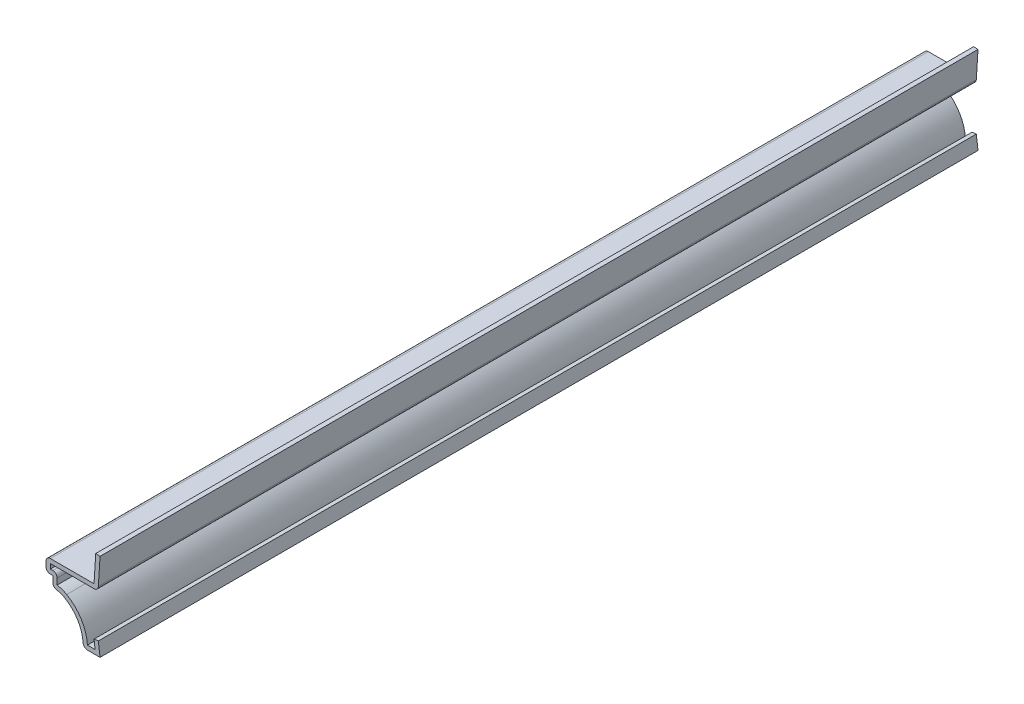
ISO-10303-21;
HEADER;
FILE_DESCRIPTION(('STEP AP214'),'2;1');
FILE_NAME('part.step','',(''),(''),'','','');
FILE_SCHEMA(('AUTOMOTIVE_DESIGN { 1 0 10303 214 1 1 1 1 }'));
ENDSEC;
DATA;
#1=APPLICATION_CONTEXT('core data for automotive mechanical design processes');
#2=APPLICATION_PROTOCOL_DEFINITION('international standard','automotive_design',2000,#1);
#3=PRODUCT_CONTEXT('',#1,'mechanical');
#4=PRODUCT('Part','Part','',(#3));
#5=PRODUCT_RELATED_PRODUCT_CATEGORY('part','',(#4));
#6=PRODUCT_DEFINITION_FORMATION('','',#4);
#7=PRODUCT_DEFINITION_CONTEXT('part definition',#1,'design');
#8=PRODUCT_DEFINITION('design','',#6,#7);
#9=PRODUCT_DEFINITION_SHAPE('','',#8);
#10=(LENGTH_UNIT() NAMED_UNIT(*) SI_UNIT(.MILLI.,.METRE.));
#11=(NAMED_UNIT(*) PLANE_ANGLE_UNIT() SI_UNIT($,.RADIAN.));
#12=(NAMED_UNIT(*) SI_UNIT($,.STERADIAN.) SOLID_ANGLE_UNIT());
#13=UNCERTAINTY_MEASURE_WITH_UNIT(LENGTH_MEASURE(1.E-05),#10,'distance_accuracy_value','');
#14=(GEOMETRIC_REPRESENTATION_CONTEXT(3) GLOBAL_UNCERTAINTY_ASSIGNED_CONTEXT((#13)) GLOBAL_UNIT_ASSIGNED_CONTEXT((#10,
#11,#12)) REPRESENTATION_CONTEXT('',''));
#15=CARTESIAN_POINT('',(0.,0.,0.));
#16=DIRECTION('',(0.,0.,1.));
#17=DIRECTION('',(1.,0.,0.));
#18=AXIS2_PLACEMENT_3D('',#15,#16,#17);
#19=CARTESIAN_POINT('',(-0.396875000000003,14.2241236612663,-206.375));
#20=DIRECTION('',(0.998052578482889,-0.0623782861551803,0.));
#21=DIRECTION('',(0.0623782861551803,0.998052578482889,0.));
#22=AXIS2_PLACEMENT_3D('',#19,#20,#21);
#23=PLANE('',#22);
#24=DIRECTION('',(0.0623782861551803,0.998052578482889,0.));
#25=VECTOR('',#24,1.);
#26=CARTESIAN_POINT('',(-0.396875000000003,14.2241236612663,0.));
#27=LINE('',#26,#25);
#28=CARTESIAN_POINT('',(-0.396875000000003,14.2241236612663,0.));
#29=VERTEX_POINT('',#28);
#30=CARTESIAN_POINT('',(0.,20.5741236612663,0.));
#31=VERTEX_POINT('',#30);
#32=EDGE_CURVE('E345',#29,#31,#27,.T.);
#33=ORIENTED_EDGE('',*,*,#32,.F.);
#34=DIRECTION('',(0.,0.,1.));
#35=VECTOR('',#34,1.);
#36=CARTESIAN_POINT('',(-0.396875000000003,14.2241236612663,-206.375));
#37=LINE('',#36,#35);
#38=CARTESIAN_POINT('',(-0.396875000000003,14.2241236612663,-206.375));
#39=VERTEX_POINT('',#38);
#40=EDGE_CURVE('E11',#29,#39,#37,.F.);
#41=ORIENTED_EDGE('',*,*,#40,.T.);
#42=DIRECTION('',(0.0623782861551803,0.998052578482889,0.));
#43=VECTOR('',#42,1.);
#44=CARTESIAN_POINT('',(-0.396875000000003,14.2241236612663,-206.375));
#45=LINE('',#44,#43);
#46=CARTESIAN_POINT('',(0.,20.5741236612663,-206.375));
#47=VERTEX_POINT('',#46);
#48=EDGE_CURVE('E209',#39,#47,#45,.T.);
#49=ORIENTED_EDGE('',*,*,#48,.T.);
#50=DIRECTION('',(0.,0.,1.));
#51=VECTOR('',#50,1.);
#52=CARTESIAN_POINT('',(0.,20.5741236612663,-206.375));
#53=LINE('',#52,#51);
#54=EDGE_CURVE('E213',#47,#31,#53,.T.);
#55=ORIENTED_EDGE('',*,*,#54,.T.);
#56=EDGE_LOOP('',(#33,#41,#49,#55));
#57=FACE_BOUND('',#56,.T.);
#58=ADVANCED_FACE('F35',(#57),#23,.T.);
#59=CARTESIAN_POINT('',(-12.7,13.2715,-206.375));
#60=DIRECTION('',(0.,-1.,0.));
#61=DIRECTION('',(0.,0.,-1.));
#62=AXIS2_PLACEMENT_3D('',#59,#60,#61);
#63=PLANE('',#62);
#64=DIRECTION('',(1.,0.,0.));
#65=VECTOR('',#64,1.);
#66=CARTESIAN_POINT('',(-12.7,13.2715,-206.375));
#67=LINE('',#66,#65);
#68=CARTESIAN_POINT('',(-11.684,13.2715,-206.375));
#69=VERTEX_POINT('',#68);
#70=CARTESIAN_POINT('',(-1.41089641973862,13.2715,-206.375));
#71=VERTEX_POINT('',#70);
#72=EDGE_CURVE('E233',#69,#71,#67,.T.);
#73=ORIENTED_EDGE('',*,*,#72,.T.);
#74=DIRECTION('',(0.,0.,1.));
#75=VECTOR('',#74,1.);
#76=CARTESIAN_POINT('',(-1.41089641973862,13.2715,-206.375));
#77=LINE('',#76,#75);
#78=CARTESIAN_POINT('',(-1.41089641973862,13.2715,0.));
#79=VERTEX_POINT('',#78);
#80=EDGE_CURVE('E43',#71,#79,#77,.T.);
#81=ORIENTED_EDGE('',*,*,#80,.T.);
#82=DIRECTION('',(1.,0.,0.));
#83=VECTOR('',#82,1.);
#84=CARTESIAN_POINT('',(-12.7,13.2715,0.));
#85=LINE('',#84,#83);
#86=CARTESIAN_POINT('',(-11.684,13.2715,0.));
#87=VERTEX_POINT('',#86);
#88=EDGE_CURVE('E218',#87,#79,#85,.T.);
#89=ORIENTED_EDGE('',*,*,#88,.F.);
#90=DIRECTION('',(0.,0.,1.));
#91=VECTOR('',#90,1.);
#92=CARTESIAN_POINT('',(-11.684,13.2715,-206.375));
#93=LINE('',#92,#91);
#94=EDGE_CURVE('E246',#69,#87,#93,.T.);
#95=ORIENTED_EDGE('',*,*,#94,.F.);
#96=EDGE_LOOP('',(#73,#81,#89,#95));
#97=FACE_BOUND('',#96,.T.);
#98=ADVANCED_FACE('F294',(#97),#63,.T.);
#99=CARTESIAN_POINT('',(-11.684,11.1125,-206.375));
#100=DIRECTION('',(1.,0.,0.));
#101=DIRECTION('',(0.,0.,-1.));
#102=AXIS2_PLACEMENT_3D('',#99,#100,#101);
#103=PLANE('',#102);
#104=DIRECTION('',(0.,1.,0.));
#105=VECTOR('',#104,1.);
#106=CARTESIAN_POINT('',(-11.684,11.1125,0.));
#107=LINE('',#106,#105);
#108=CARTESIAN_POINT('',(-11.684,12.1285,0.));
#109=VERTEX_POINT('',#108);
#110=EDGE_CURVE('E302',#109,#87,#107,.T.);
#111=ORIENTED_EDGE('',*,*,#110,.F.);
#112=DIRECTION('',(0.,0.,1.));
#113=VECTOR('',#112,1.);
#114=CARTESIAN_POINT('',(-11.684,12.1285,-206.375));
#115=LINE('',#114,#113);
#116=CARTESIAN_POINT('',(-11.684,12.1285,-206.375));
#117=VERTEX_POINT('',#116);
#118=EDGE_CURVE('E309',#117,#109,#115,.T.);
#119=ORIENTED_EDGE('',*,*,#118,.F.);
#120=DIRECTION('',(0.,1.,0.));
#121=VECTOR('',#120,1.);
#122=CARTESIAN_POINT('',(-11.684,11.1125,-206.375));
#123=LINE('',#122,#121);
#124=EDGE_CURVE('E238',#117,#69,#123,.T.);
#125=ORIENTED_EDGE('',*,*,#124,.T.);
#126=ORIENTED_EDGE('',*,*,#94,.T.);
#127=EDGE_LOOP('',(#111,#119,#125,#126));
#128=FACE_BOUND('',#127,.T.);
#129=ADVANCED_FACE('F391',(#128),#103,.T.);
#130=CARTESIAN_POINT('',(-11.1125,12.1285,-206.375));
#131=DIRECTION('',(0.,1.,0.));
#132=DIRECTION('',(0.,0.,1.));
#133=AXIS2_PLACEMENT_3D('',#130,#131,#132);
#134=PLANE('',#133);
#135=DIRECTION('',(1.,0.,0.));
#136=VECTOR('',#135,1.);
#137=CARTESIAN_POINT('',(-11.1125,12.1285,0.));
#138=LINE('',#137,#136);
#139=CARTESIAN_POINT('',(-11.1125,12.1285,0.));
#140=VERTEX_POINT('',#139);
#141=EDGE_CURVE('E304',#140,#109,#138,.F.);
#142=ORIENTED_EDGE('',*,*,#141,.F.);
#143=DIRECTION('',(0.,0.,1.));
#144=VECTOR('',#143,1.);
#145=CARTESIAN_POINT('',(-11.1125,12.1285,-206.375));
#146=LINE('',#145,#144);
#147=CARTESIAN_POINT('',(-11.1125,12.1285,-206.375));
#148=VERTEX_POINT('',#147);
#149=EDGE_CURVE('E279',#140,#148,#146,.F.);
#150=ORIENTED_EDGE('',*,*,#149,.T.);
#151=DIRECTION('',(1.,0.,0.));
#152=VECTOR('',#151,1.);
#153=CARTESIAN_POINT('',(-11.1125,12.1285,-206.375));
#154=LINE('',#153,#152);
#155=EDGE_CURVE('E387',#148,#117,#154,.F.);
#156=ORIENTED_EDGE('',*,*,#155,.T.);
#157=ORIENTED_EDGE('',*,*,#118,.T.);
#158=EDGE_LOOP('',(#142,#150,#156,#157));
#159=FACE_BOUND('',#158,.T.);
#160=ADVANCED_FACE('F385',(#159),#134,.T.);
#161=CARTESIAN_POINT('',(-10.0965,8.73125,-206.375));
#162=DIRECTION('',(1.,0.,0.));
#163=DIRECTION('',(0.,0.,-1.));
#164=AXIS2_PLACEMENT_3D('',#161,#162,#163);
#165=PLANE('',#164);
#166=DIRECTION('',(0.,1.,0.));
#167=VECTOR('',#166,1.);
#168=CARTESIAN_POINT('',(-10.0965,8.73125,-206.375));
#169=LINE('',#168,#167);
#170=CARTESIAN_POINT('',(-10.0965,9.66824372424907,-206.375));
#171=VERTEX_POINT('',#170);
#172=CARTESIAN_POINT('',(-10.0965,11.1125,-206.375));
#173=VERTEX_POINT('',#172);
#174=EDGE_CURVE('E465',#171,#173,#169,.T.);
#175=ORIENTED_EDGE('',*,*,#174,.T.);
#176=DIRECTION('',(0.,0.,1.));
#177=VECTOR('',#176,1.);
#178=CARTESIAN_POINT('',(-10.0965,11.1125,-206.375));
#179=LINE('',#178,#177);
#180=CARTESIAN_POINT('',(-10.0965,11.1125,0.));
#181=VERTEX_POINT('',#180);
#182=EDGE_CURVE('E276',#173,#181,#179,.T.);
#183=ORIENTED_EDGE('',*,*,#182,.T.);
#184=DIRECTION('',(0.,1.,0.));
#185=VECTOR('',#184,1.);
#186=CARTESIAN_POINT('',(-10.0965,8.73125,0.));
#187=LINE('',#186,#185);
#188=CARTESIAN_POINT('',(-10.0965,9.66824372424907,0.));
#189=VERTEX_POINT('',#188);
#190=EDGE_CURVE('E379',#189,#181,#187,.T.);
#191=ORIENTED_EDGE('',*,*,#190,.F.);
#192=DIRECTION('',(0.,0.,1.));
#193=VECTOR('',#192,1.);
#194=CARTESIAN_POINT('',(-10.0965,9.66824372424907,-206.375));
#195=LINE('',#194,#193);
#196=EDGE_CURVE('E312',#171,#189,#195,.T.);
#197=ORIENTED_EDGE('',*,*,#196,.F.);
#198=EDGE_LOOP('',(#175,#183,#191,#197));
#199=FACE_BOUND('',#198,.T.);
#200=ADVANCED_FACE('F471',(#199),#165,.T.);
#201=CARTESIAN_POINT('',(-11.1125,3.175,-206.375));
#202=DIRECTION('',(0.,0.,1.));
#203=DIRECTION('',(1.,0.,0.));
#204=AXIS2_PLACEMENT_3D('',#201,#202,#203);
#205=CYLINDRICAL_SURFACE('',#204,6.57225);
#206=CARTESIAN_POINT('',(-11.1125,3.175,0.));
#207=DIRECTION('',(0.,0.,1.));
#208=DIRECTION('',(1.,0.,0.));
#209=AXIS2_PLACEMENT_3D('',#206,#207,#208);
#210=CIRCLE('',#209,6.57225);
#211=CARTESIAN_POINT('',(-7.84725470729786,8.87873940857982,0.));
#212=VERTEX_POINT('',#211);
#213=EDGE_CURVE('E376',#212,#189,#210,.T.);
#214=ORIENTED_EDGE('',*,*,#213,.F.);
#215=DIRECTION('',(0.,0.,1.));
#216=VECTOR('',#215,1.);
#217=CARTESIAN_POINT('',(-7.84725470729786,8.87873940857982,-206.375));
#218=LINE('',#217,#216);
#219=CARTESIAN_POINT('',(-7.84725470729786,8.87873940857982,-206.375));
#220=VERTEX_POINT('',#219);
#221=EDGE_CURVE('E314',#220,#212,#218,.T.);
#222=ORIENTED_EDGE('',*,*,#221,.F.);
#223=CARTESIAN_POINT('',(-11.1125,3.175,-206.375));
#224=DIRECTION('',(0.,0.,1.));
#225=DIRECTION('',(1.,0.,0.));
#226=AXIS2_PLACEMENT_3D('',#223,#224,#225);
#227=CIRCLE('',#226,6.57225);
#228=EDGE_CURVE('E462',#220,#171,#227,.T.);
#229=ORIENTED_EDGE('',*,*,#228,.T.);
#230=ORIENTED_EDGE('',*,*,#196,.T.);
#231=EDGE_LOOP('',(#214,#222,#229,#230));
#232=FACE_BOUND('',#231,.T.);
#233=ADVANCED_FACE('F478',(#232),#205,.T.);
#234=CARTESIAN_POINT('',(-12.6899131848803,0.419570334019411,-206.375));
#235=DIRECTION('',(0.,0.,1.));
#236=DIRECTION('',(1.,0.,0.));
#237=AXIS2_PLACEMENT_3D('',#234,#235,#236);
#238=CYLINDRICAL_SURFACE('',#237,9.74725);
#239=CARTESIAN_POINT('',(-12.6899131848803,0.419570334019411,0.));
#240=DIRECTION('',(0.,0.,1.));
#241=DIRECTION('',(1.,0.,0.));
#242=AXIS2_PLACEMENT_3D('',#239,#240,#241);
#243=CIRCLE('',#242,9.74725);
#244=CARTESIAN_POINT('',(-2.96092792350597,1.016,0.));
#245=VERTEX_POINT('',#244);
#246=EDGE_CURVE('E373',#245,#212,#243,.T.);
#247=ORIENTED_EDGE('',*,*,#246,.F.);
#248=DIRECTION('',(0.,0.,1.));
#249=VECTOR('',#248,1.);
#250=CARTESIAN_POINT('',(-2.96092792350597,1.016,-206.375));
#251=LINE('',#250,#249);
#252=CARTESIAN_POINT('',(-2.96092792350597,1.016,-206.375));
#253=VERTEX_POINT('',#252);
#254=EDGE_CURVE('E316',#253,#245,#251,.T.);
#255=ORIENTED_EDGE('',*,*,#254,.F.);
#256=CARTESIAN_POINT('',(-12.6899131848803,0.419570334019411,-206.375));
#257=DIRECTION('',(0.,0.,1.));
#258=DIRECTION('',(1.,0.,0.));
#259=AXIS2_PLACEMENT_3D('',#256,#257,#258);
#260=CIRCLE('',#259,9.74725);
#261=EDGE_CURVE('E459',#253,#220,#260,.T.);
#262=ORIENTED_EDGE('',*,*,#261,.T.);
#263=ORIENTED_EDGE('',*,*,#221,.T.);
#264=EDGE_LOOP('',(#247,#255,#262,#263));
#265=FACE_BOUND('',#264,.T.);
#266=ADVANCED_FACE('F481',(#265),#238,.T.);
#267=CARTESIAN_POINT('',(0.,1.016,-206.375));
#268=DIRECTION('',(0.,1.,0.));
#269=DIRECTION('',(-1.,0.,0.));
#270=AXIS2_PLACEMENT_3D('',#267,#268,#269);
#271=PLANE('',#270);
#272=DIRECTION('',(-1.,0.,0.));
#273=VECTOR('',#272,1.);
#274=CARTESIAN_POINT('',(0.,1.016,0.));
#275=LINE('',#274,#273);
#276=CARTESIAN_POINT('',(-1.15203571373212,1.016,0.));
#277=VERTEX_POINT('',#276);
#278=EDGE_CURVE('E370',#277,#245,#275,.T.);
#279=ORIENTED_EDGE('',*,*,#278,.F.);
#280=DIRECTION('',(0.,0.,1.));
#281=VECTOR('',#280,1.);
#282=CARTESIAN_POINT('',(-1.15203571373212,1.016,-206.375));
#283=LINE('',#282,#281);
#284=CARTESIAN_POINT('',(-1.15203571373212,1.016,-206.375));
#285=VERTEX_POINT('',#284);
#286=EDGE_CURVE('E318',#285,#277,#283,.T.);
#287=ORIENTED_EDGE('',*,*,#286,.F.);
#288=DIRECTION('',(-1.,0.,0.));
#289=VECTOR('',#288,1.);
#290=CARTESIAN_POINT('',(0.,1.016,-206.375));
#291=LINE('',#290,#289);
#292=EDGE_CURVE('E456',#285,#253,#291,.T.);
#293=ORIENTED_EDGE('',*,*,#292,.T.);
#294=ORIENTED_EDGE('',*,*,#254,.T.);
#295=EDGE_LOOP('',(#279,#287,#293,#294));
#296=FACE_BOUND('',#295,.T.);
#297=ADVANCED_FACE('F486',(#296),#271,.T.);
#298=CARTESIAN_POINT('',(-1.40490624951561,3.02309765473628,-206.375));
#299=DIRECTION('',(-0.992156741649221,-0.125,0.));
#300=DIRECTION('',(0.125,-0.992156741649222,0.));
#301=AXIS2_PLACEMENT_3D('',#298,#299,#300);
#302=PLANE('',#301);
#303=DIRECTION('',(0.125,-0.992156741649221,0.));
#304=VECTOR('',#303,1.);
#305=CARTESIAN_POINT('',(-1.40490624951561,3.02309765473628,0.));
#306=LINE('',#305,#304);
#307=CARTESIAN_POINT('',(-1.40490624951561,3.02309765473628,0.));
#308=VERTEX_POINT('',#307);
#309=EDGE_CURVE('E367',#308,#277,#306,.T.);
#310=ORIENTED_EDGE('',*,*,#309,.F.);
#311=DIRECTION('',(0.,0.,1.));
#312=VECTOR('',#311,1.);
#313=CARTESIAN_POINT('',(-1.40490624951561,3.02309765473628,-206.375));
#314=LINE('',#313,#312);
#315=CARTESIAN_POINT('',(-1.40490624951561,3.02309765473628,-206.375));
#316=VERTEX_POINT('',#315);
#317=EDGE_CURVE('E320',#316,#308,#314,.T.);
#318=ORIENTED_EDGE('',*,*,#317,.F.);
#319=DIRECTION('',(0.125,-0.992156741649221,0.));
#320=VECTOR('',#319,1.);
#321=CARTESIAN_POINT('',(-1.40490624951561,3.02309765473628,-206.375));
#322=LINE('',#321,#320);
#323=EDGE_CURVE('E453',#316,#285,#322,.T.);
#324=ORIENTED_EDGE('',*,*,#323,.T.);
#325=ORIENTED_EDGE('',*,*,#286,.T.);
#326=EDGE_LOOP('',(#310,#318,#324,#325));
#327=FACE_BOUND('',#326,.T.);
#328=ADVANCED_FACE('F489',(#327),#302,.T.);
#329=CARTESIAN_POINT('',(-1.40490624951561,3.02309765473628,-206.375));
#330=DIRECTION('',(0.125,-0.992156741649222,0.));
#331=DIRECTION('',(0.992156741649222,0.125,0.));
#332=AXIS2_PLACEMENT_3D('',#329,#330,#331);
#333=PLANE('',#332);
#334=DIRECTION('',(0.992156741649222,0.125,0.));
#335=VECTOR('',#334,1.);
#336=CARTESIAN_POINT('',(-1.40490624951561,3.02309765473628,0.));
#337=LINE('',#336,#335);
#338=CARTESIAN_POINT('',(-0.396875,3.15009765473628,0.));
#339=VERTEX_POINT('',#338);
#340=EDGE_CURVE('E365',#308,#339,#337,.T.);
#341=ORIENTED_EDGE('',*,*,#340,.T.);
#342=DIRECTION('',(0.,0.,1.));
#343=VECTOR('',#342,1.);
#344=CARTESIAN_POINT('',(-0.396875,3.15009765473628,-206.375));
#345=LINE('',#344,#343);
#346=CARTESIAN_POINT('',(-0.396875,3.15009765473628,-206.375));
#347=VERTEX_POINT('',#346);
#348=EDGE_CURVE('E322',#347,#339,#345,.T.);
#349=ORIENTED_EDGE('',*,*,#348,.F.);
#350=DIRECTION('',(0.992156741649222,0.125,0.));
#351=VECTOR('',#350,1.);
#352=CARTESIAN_POINT('',(-1.40490624951561,3.02309765473628,-206.375));
#353=LINE('',#352,#351);
#354=EDGE_CURVE('E451',#316,#347,#353,.T.);
#355=ORIENTED_EDGE('',*,*,#354,.F.);
#356=ORIENTED_EDGE('',*,*,#317,.T.);
#357=EDGE_LOOP('',(#341,#349,#355,#356));
#358=FACE_BOUND('',#357,.T.);
#359=ADVANCED_FACE('F495',(#358),#333,.F.);
#360=CARTESIAN_POINT('',(-0.396875,3.15009765473628,-206.375));
#361=DIRECTION('',(-0.992156741649221,-0.125,0.));
#362=DIRECTION('',(0.125,-0.992156741649222,0.));
#363=AXIS2_PLACEMENT_3D('',#360,#361,#362);
#364=PLANE('',#363);
#365=DIRECTION('',(0.125,-0.992156741649221,0.));
#366=VECTOR('',#365,1.);
#367=CARTESIAN_POINT('',(-0.396875,3.15009765473628,0.));
#368=LINE('',#367,#366);
#369=CARTESIAN_POINT('',(0.,0.,0.));
#370=VERTEX_POINT('',#369);
#371=EDGE_CURVE('E363',#339,#370,#368,.T.);
#372=ORIENTED_EDGE('',*,*,#371,.T.);
#373=DIRECTION('',(0.,0.,1.));
#374=VECTOR('',#373,1.);
#375=CARTESIAN_POINT('',(0.,0.,-206.375));
#376=LINE('',#375,#374);
#377=CARTESIAN_POINT('',(0.,0.,-206.375));
#378=VERTEX_POINT('',#377);
#379=EDGE_CURVE('E325',#378,#370,#376,.T.);
#380=ORIENTED_EDGE('',*,*,#379,.F.);
#381=DIRECTION('',(0.125,-0.992156741649221,0.));
#382=VECTOR('',#381,1.);
#383=CARTESIAN_POINT('',(-0.396875,3.15009765473628,-206.375));
#384=LINE('',#383,#382);
#385=EDGE_CURVE('E449',#347,#378,#384,.T.);
#386=ORIENTED_EDGE('',*,*,#385,.F.);
#387=ORIENTED_EDGE('',*,*,#348,.T.);
#388=EDGE_LOOP('',(#372,#380,#386,#387));
#389=FACE_BOUND('',#388,.T.);
#390=ADVANCED_FACE('F499',(#389),#364,.F.);
#391=CARTESIAN_POINT('',(0.,0.,-206.375));
#392=DIRECTION('',(0.,1.,0.));
#393=DIRECTION('',(-1.,0.,0.));
#394=AXIS2_PLACEMENT_3D('',#391,#392,#393);
#395=PLANE('',#394);
#396=DIRECTION('',(-1.,0.,0.));
#397=VECTOR('',#396,1.);
#398=CARTESIAN_POINT('',(0.,0.,0.));
#399=LINE('',#398,#397);
#400=CARTESIAN_POINT('',(-2.96092792350597,0.,0.));
#401=VERTEX_POINT('',#400);
#402=EDGE_CURVE('E360',#370,#401,#399,.T.);
#403=ORIENTED_EDGE('',*,*,#402,.T.);
#404=DIRECTION('',(0.,0.,1.));
#405=VECTOR('',#404,1.);
#406=CARTESIAN_POINT('',(-2.96092792350597,0.,-206.375));
#407=LINE('',#406,#405);
#408=CARTESIAN_POINT('',(-2.96092792350597,0.,-206.375));
#409=VERTEX_POINT('',#408);
#410=EDGE_CURVE('E258',#401,#409,#407,.F.);
#411=ORIENTED_EDGE('',*,*,#410,.T.);
#412=DIRECTION('',(-1.,0.,0.));
#413=VECTOR('',#412,1.);
#414=CARTESIAN_POINT('',(0.,0.,-206.375));
#415=LINE('',#414,#413);
#416=EDGE_CURVE('E447',#378,#409,#415,.T.);
#417=ORIENTED_EDGE('',*,*,#416,.F.);
#418=ORIENTED_EDGE('',*,*,#379,.T.);
#419=EDGE_LOOP('',(#403,#411,#417,#418));
#420=FACE_BOUND('',#419,.T.);
#421=ADVANCED_FACE('F503',(#420),#395,.F.);
#422=CARTESIAN_POINT('',(-12.6899131848803,0.419570334019411,-206.375));
#423=DIRECTION('',(0.,0.,1.));
#424=DIRECTION('',(1.,0.,0.));
#425=AXIS2_PLACEMENT_3D('',#422,#423,#424);
#426=CYLINDRICAL_SURFACE('',#425,8.73125);
#427=CARTESIAN_POINT('',(-12.6899131848803,0.419570334019411,-206.375));
#428=DIRECTION('',(0.,0.,1.));
#429=DIRECTION('',(-1.,0.,0.));
#430=AXIS2_PLACEMENT_3D('',#427,#428,#429);
#431=CIRCLE('',#430,8.73125);
#432=CARTESIAN_POINT('',(-3.97502410710198,0.953831435467821,-206.375));
#433=VERTEX_POINT('',#432);
#434=CARTESIAN_POINT('',(-8.35202692645954,7.99700191546603,-206.375));
#435=VERTEX_POINT('',#434);
#436=EDGE_CURVE('E445',#433,#435,#431,.T.);
#437=ORIENTED_EDGE('',*,*,#436,.F.);
#438=DIRECTION('',(0.,0.,1.));
#439=VECTOR('',#438,1.);
#440=CARTESIAN_POINT('',(-3.97502410710198,0.953831435467821,-206.375));
#441=LINE('',#440,#439);
#442=CARTESIAN_POINT('',(-3.97502410710198,0.953831435467821,0.));
#443=VERTEX_POINT('',#442);
#444=EDGE_CURVE('E242',#433,#443,#441,.T.);
#445=ORIENTED_EDGE('',*,*,#444,.T.);
#446=CARTESIAN_POINT('',(-12.6899131848803,0.419570334019411,0.));
#447=DIRECTION('',(0.,0.,1.));
#448=DIRECTION('',(-1.,0.,0.));
#449=AXIS2_PLACEMENT_3D('',#446,#447,#448);
#450=CIRCLE('',#449,8.73125);
#451=CARTESIAN_POINT('',(-8.35202692645954,7.99700191546603,0.));
#452=VERTEX_POINT('',#451);
#453=EDGE_CURVE('E358',#443,#452,#450,.T.);
#454=ORIENTED_EDGE('',*,*,#453,.T.);
#455=DIRECTION('',(0.,0.,1.));
#456=VECTOR('',#455,1.);
#457=CARTESIAN_POINT('',(-8.35202692645954,7.99700191546603,-206.375));
#458=LINE('',#457,#456);
#459=EDGE_CURVE('E328',#435,#452,#458,.T.);
#460=ORIENTED_EDGE('',*,*,#459,.F.);
#461=EDGE_LOOP('',(#437,#445,#454,#460));
#462=FACE_BOUND('',#461,.T.);
#463=ADVANCED_FACE('F509',(#462),#426,.F.);
#464=CARTESIAN_POINT('',(-11.1125,3.175,-206.375));
#465=DIRECTION('',(0.,0.,1.));
#466=DIRECTION('',(1.,0.,0.));
#467=AXIS2_PLACEMENT_3D('',#464,#465,#466);
#468=CYLINDRICAL_SURFACE('',#467,5.55625);
#469=CARTESIAN_POINT('',(-11.1125,3.175,0.));
#470=DIRECTION('',(0.,0.,1.));
#471=DIRECTION('',(-1.,0.,0.));
#472=AXIS2_PLACEMENT_3D('',#469,#470,#471);
#473=CIRCLE('',#472,5.55625);
#474=CARTESIAN_POINT('',(-10.2535628019324,8.66445725479994,0.));
#475=VERTEX_POINT('',#474);
#476=EDGE_CURVE('E355',#452,#475,#473,.T.);
#477=ORIENTED_EDGE('',*,*,#476,.T.);
#478=DIRECTION('',(0.,0.,1.));
#479=VECTOR('',#478,1.);
#480=CARTESIAN_POINT('',(-10.2535628019324,8.66445725479994,-206.375));
#481=LINE('',#480,#479);
#482=CARTESIAN_POINT('',(-10.2535628019324,8.66445725479994,-206.375));
#483=VERTEX_POINT('',#482);
#484=EDGE_CURVE('E274',#475,#483,#481,.F.);
#485=ORIENTED_EDGE('',*,*,#484,.T.);
#486=CARTESIAN_POINT('',(-11.1125,3.175,-206.375));
#487=DIRECTION('',(0.,0.,1.));
#488=DIRECTION('',(-1.,0.,0.));
#489=AXIS2_PLACEMENT_3D('',#486,#487,#488);
#490=CIRCLE('',#489,5.55625);
#491=EDGE_CURVE('E442',#435,#483,#490,.T.);
#492=ORIENTED_EDGE('',*,*,#491,.F.);
#493=ORIENTED_EDGE('',*,*,#459,.T.);
#494=EDGE_LOOP('',(#477,#485,#492,#493));
#495=FACE_BOUND('',#494,.T.);
#496=ADVANCED_FACE('F515',(#495),#468,.F.);
#497=CARTESIAN_POINT('',(-11.1125,8.73125,-206.375));
#498=DIRECTION('',(1.,0.,0.));
#499=DIRECTION('',(0.,0.,-1.));
#500=AXIS2_PLACEMENT_3D('',#497,#498,#499);
#501=PLANE('',#500);
#502=DIRECTION('',(0.,1.,0.));
#503=VECTOR('',#502,1.);
#504=CARTESIAN_POINT('',(-11.1125,8.73125,-206.375));
#505=LINE('',#504,#503);
#506=CARTESIAN_POINT('',(-11.1125,9.66824372424907,-206.375));
#507=VERTEX_POINT('',#506);
#508=CARTESIAN_POINT('',(-11.1125,11.1125,-206.375));
#509=VERTEX_POINT('',#508);
#510=EDGE_CURVE('E436',#507,#509,#505,.T.);
#511=ORIENTED_EDGE('',*,*,#510,.F.);
#512=DIRECTION('',(0.,0.,1.));
#513=VECTOR('',#512,1.);
#514=CARTESIAN_POINT('',(-11.1125,9.66824372424907,-206.375));
#515=LINE('',#514,#513);
#516=CARTESIAN_POINT('',(-11.1125,9.66824372424907,0.));
#517=VERTEX_POINT('',#516);
#518=EDGE_CURVE('E271',#507,#517,#515,.T.);
#519=ORIENTED_EDGE('',*,*,#518,.T.);
#520=DIRECTION('',(0.,1.,0.));
#521=VECTOR('',#520,1.);
#522=CARTESIAN_POINT('',(-11.1125,8.73125,0.));
#523=LINE('',#522,#521);
#524=CARTESIAN_POINT('',(-11.1125,11.1125,0.));
#525=VERTEX_POINT('',#524);
#526=EDGE_CURVE('E353',#517,#525,#523,.T.);
#527=ORIENTED_EDGE('',*,*,#526,.T.);
#528=DIRECTION('',(0.,0.,1.));
#529=VECTOR('',#528,1.);
#530=CARTESIAN_POINT('',(-11.1125,11.1125,-206.375));
#531=LINE('',#530,#529);
#532=EDGE_CURVE('E331',#509,#525,#531,.T.);
#533=ORIENTED_EDGE('',*,*,#532,.F.);
#534=EDGE_LOOP('',(#511,#519,#527,#533));
#535=FACE_BOUND('',#534,.T.);
#536=ADVANCED_FACE('F522',(#535),#501,.F.);
#537=CARTESIAN_POINT('',(-11.1125,11.1125,-206.375));
#538=DIRECTION('',(0.,1.,0.));
#539=DIRECTION('',(0.,0.,1.));
#540=AXIS2_PLACEMENT_3D('',#537,#538,#539);
#541=PLANE('',#540);
#542=DIRECTION('',(-1.,0.,0.));
#543=VECTOR('',#542,1.);
#544=CARTESIAN_POINT('',(-11.1125,11.1125,0.));
#545=LINE('',#544,#543);
#546=CARTESIAN_POINT('',(-11.684,11.1125,0.));
#547=VERTEX_POINT('',#546);
#548=EDGE_CURVE('E350',#525,#547,#545,.T.);
#549=ORIENTED_EDGE('',*,*,#548,.T.);
#550=DIRECTION('',(0.,0.,1.));
#551=VECTOR('',#550,1.);
#552=CARTESIAN_POINT('',(-11.684,11.1125,-206.375));
#553=LINE('',#552,#551);
#554=CARTESIAN_POINT('',(-11.684,11.1125,-206.375));
#555=VERTEX_POINT('',#554);
#556=EDGE_CURVE('E285',#547,#555,#553,.F.);
#557=ORIENTED_EDGE('',*,*,#556,.T.);
#558=DIRECTION('',(-1.,0.,0.));
#559=VECTOR('',#558,1.);
#560=CARTESIAN_POINT('',(-11.1125,11.1125,-206.375));
#561=LINE('',#560,#559);
#562=EDGE_CURVE('E431',#509,#555,#561,.T.);
#563=ORIENTED_EDGE('',*,*,#562,.F.);
#564=ORIENTED_EDGE('',*,*,#532,.T.);
#565=EDGE_LOOP('',(#549,#557,#563,#564));
#566=FACE_BOUND('',#565,.T.);
#567=ADVANCED_FACE('F525',(#566),#541,.F.);
#568=CARTESIAN_POINT('',(-12.7,11.1125,-206.375));
#569=DIRECTION('',(1.,0.,0.));
#570=DIRECTION('',(0.,0.,-1.));
#571=AXIS2_PLACEMENT_3D('',#568,#569,#570);
#572=PLANE('',#571);
#573=DIRECTION('',(0.,1.,0.));
#574=VECTOR('',#573,1.);
#575=CARTESIAN_POINT('',(-12.7,11.1125,-206.375));
#576=LINE('',#575,#574);
#577=CARTESIAN_POINT('',(-12.7,12.1285,-206.375));
#578=VERTEX_POINT('',#577);
#579=CARTESIAN_POINT('',(-12.7,13.2715,-206.375));
#580=VERTEX_POINT('',#579);
#581=EDGE_CURVE('E429',#578,#580,#576,.T.);
#582=ORIENTED_EDGE('',*,*,#581,.F.);
#583=DIRECTION('',(0.,0.,1.));
#584=VECTOR('',#583,1.);
#585=CARTESIAN_POINT('',(-12.7,12.1285,-206.375));
#586=LINE('',#585,#584);
#587=CARTESIAN_POINT('',(-12.7,12.1285,0.));
#588=VERTEX_POINT('',#587);
#589=EDGE_CURVE('E282',#578,#588,#586,.T.);
#590=ORIENTED_EDGE('',*,*,#589,.T.);
#591=DIRECTION('',(0.,1.,0.));
#592=VECTOR('',#591,1.);
#593=CARTESIAN_POINT('',(-12.7,11.1125,0.));
#594=LINE('',#593,#592);
#595=CARTESIAN_POINT('',(-12.7,13.2715,0.));
#596=VERTEX_POINT('',#595);
#597=EDGE_CURVE('E343',#588,#596,#594,.T.);
#598=ORIENTED_EDGE('',*,*,#597,.T.);
#599=DIRECTION('',(0.,0.,1.));
#600=VECTOR('',#599,1.);
#601=CARTESIAN_POINT('',(-12.7,13.2715,-206.375));
#602=LINE('',#601,#600);
#603=EDGE_CURVE('E58',#596,#580,#602,.F.);
#604=ORIENTED_EDGE('',*,*,#603,.T.);
#605=EDGE_LOOP('',(#582,#590,#598,#604));
#606=FACE_BOUND('',#605,.T.);
#607=ADVANCED_FACE('F432',(#606),#572,.F.);
#608=CARTESIAN_POINT('',(-12.7,14.2875,-206.375));
#609=DIRECTION('',(0.,-1.,0.));
#610=DIRECTION('',(0.,0.,-1.));
#611=AXIS2_PLACEMENT_3D('',#608,#609,#610);
#612=PLANE('',#611);
#613=DIRECTION('',(1.,0.,0.));
#614=VECTOR('',#613,1.);
#615=CARTESIAN_POINT('',(-12.7,14.2875,-206.375));
#616=LINE('',#615,#614);
#617=CARTESIAN_POINT('',(-11.684,14.2875,-206.375));
#618=VERTEX_POINT('',#617);
#619=CARTESIAN_POINT('',(-1.41089641973862,14.2875,-206.375));
#620=VERTEX_POINT('',#619);
#621=EDGE_CURVE('E434',#618,#620,#616,.T.);
#622=ORIENTED_EDGE('',*,*,#621,.F.);
#623=DIRECTION('',(0.,0.,1.));
#624=VECTOR('',#623,1.);
#625=CARTESIAN_POINT('',(-11.684,14.2875,-206.375));
#626=LINE('',#625,#624);
#627=CARTESIAN_POINT('',(-11.684,14.2875,0.));
#628=VERTEX_POINT('',#627);
#629=EDGE_CURVE('E287',#618,#628,#626,.T.);
#630=ORIENTED_EDGE('',*,*,#629,.T.);
#631=DIRECTION('',(1.,0.,0.));
#632=VECTOR('',#631,1.);
#633=CARTESIAN_POINT('',(-12.7,14.2875,0.));
#634=LINE('',#633,#632);
#635=CARTESIAN_POINT('',(-1.41089641973862,14.2875,0.));
#636=VERTEX_POINT('',#635);
#637=EDGE_CURVE('E341',#628,#636,#634,.T.);
#638=ORIENTED_EDGE('',*,*,#637,.T.);
#639=DIRECTION('',(0.,0.,1.));
#640=VECTOR('',#639,1.);
#641=CARTESIAN_POINT('',(-1.41089641973862,14.2875,-206.375));
#642=LINE('',#641,#640);
#643=EDGE_CURVE('E235',#620,#636,#642,.T.);
#644=ORIENTED_EDGE('',*,*,#643,.F.);
#645=EDGE_LOOP('',(#622,#630,#638,#644));
#646=FACE_BOUND('',#645,.T.);
#647=ADVANCED_FACE('F527',(#646),#612,.F.);
#648=CARTESIAN_POINT('',(-1.41089641973862,14.2875,-206.375));
#649=DIRECTION('',(0.998052578482889,-0.0623782861551803,0.));
#650=DIRECTION('',(0.0623782861551803,0.998052578482889,0.));
#651=AXIS2_PLACEMENT_3D('',#648,#649,#650);
#652=PLANE('',#651);
#653=DIRECTION('',(0.0623782861551803,0.998052578482889,0.));
#654=VECTOR('',#653,1.);
#655=CARTESIAN_POINT('',(-1.41089641973862,14.2875,0.));
#656=LINE('',#655,#654);
#657=CARTESIAN_POINT('',(-1.01402141973862,20.6375,0.));
#658=VERTEX_POINT('',#657);
#659=EDGE_CURVE('E338',#636,#658,#656,.T.);
#660=ORIENTED_EDGE('',*,*,#659,.T.);
#661=DIRECTION('',(0.,0.,1.));
#662=VECTOR('',#661,1.);
#663=CARTESIAN_POINT('',(-1.01402141973862,20.6375,-206.375));
#664=LINE('',#663,#662);
#665=CARTESIAN_POINT('',(-1.01402141973862,20.6375,-206.375));
#666=VERTEX_POINT('',#665);
#667=EDGE_CURVE('E232',#666,#658,#664,.T.);
#668=ORIENTED_EDGE('',*,*,#667,.F.);
#669=DIRECTION('',(0.0623782861551803,0.998052578482889,0.));
#670=VECTOR('',#669,1.);
#671=CARTESIAN_POINT('',(-1.41089641973862,14.2875,-206.375));
#672=LINE('',#671,#670);
#673=EDGE_CURVE('E224',#620,#666,#672,.T.);
#674=ORIENTED_EDGE('',*,*,#673,.F.);
#675=ORIENTED_EDGE('',*,*,#643,.T.);
#676=EDGE_LOOP('',(#660,#668,#674,#675));
#677=FACE_BOUND('',#676,.T.);
#678=ADVANCED_FACE('F337',(#677),#652,.F.);
#679=CARTESIAN_POINT('',(-1.01402141973862,20.6375,-206.375));
#680=DIRECTION('',(-0.0623782861551768,-0.998052578482889,0.));
#681=DIRECTION('',(0.998052578482889,-0.0623782861551768,0.));
#682=AXIS2_PLACEMENT_3D('',#679,#680,#681);
#683=PLANE('',#682);
#684=DIRECTION('',(0.998052578482889,-0.0623782861551768,0.));
#685=VECTOR('',#684,1.);
#686=CARTESIAN_POINT('',(-1.01402141973862,20.6375,0.));
#687=LINE('',#686,#685);
#688=EDGE_CURVE('E231',#658,#31,#687,.T.);
#689=ORIENTED_EDGE('',*,*,#688,.T.);
#690=ORIENTED_EDGE('',*,*,#54,.F.);
#691=DIRECTION('',(0.998052578482889,-0.0623782861551768,0.));
#692=VECTOR('',#691,1.);
#693=CARTESIAN_POINT('',(-1.01402141973862,20.6375,-206.375));
#694=LINE('',#693,#692);
#695=EDGE_CURVE('E217',#666,#47,#694,.T.);
#696=ORIENTED_EDGE('',*,*,#695,.F.);
#697=ORIENTED_EDGE('',*,*,#667,.T.);
#698=EDGE_LOOP('',(#689,#690,#696,#697));
#699=FACE_BOUND('',#698,.T.);
#700=ADVANCED_FACE('F229',(#699),#683,.F.);
#701=CARTESIAN_POINT('',(-11.1125,3.175,-206.375));
#702=DIRECTION('',(0.,0.,1.));
#703=DIRECTION('',(1.,0.,0.));
#704=AXIS2_PLACEMENT_3D('',#701,#702,#703);
#705=PLANE('',#704);
#706=ORIENTED_EDGE('',*,*,#416,.T.);
#707=CARTESIAN_POINT('',(-2.96092792350597,1.016,-206.375));
#708=DIRECTION('',(0.,0.,1.));
#709=DIRECTION('',(1.,0.,0.));
#710=AXIS2_PLACEMENT_3D('',#707,#708,#709);
#711=CIRCLE('',#710,1.016);
#712=EDGE_CURVE('E269',#409,#433,#711,.F.);
#713=ORIENTED_EDGE('',*,*,#712,.T.);
#714=ORIENTED_EDGE('',*,*,#436,.T.);
#715=ORIENTED_EDGE('',*,*,#491,.T.);
#716=CARTESIAN_POINT('',(-10.0965,9.66824372424907,-206.375));
#717=DIRECTION('',(0.,0.,1.));
#718=DIRECTION('',(1.,0.,0.));
#719=AXIS2_PLACEMENT_3D('',#716,#717,#718);
#720=CIRCLE('',#719,1.016);
#721=EDGE_CURVE('E267',#483,#507,#720,.F.);
#722=ORIENTED_EDGE('',*,*,#721,.T.);
#723=ORIENTED_EDGE('',*,*,#510,.T.);
#724=ORIENTED_EDGE('',*,*,#562,.T.);
#725=CARTESIAN_POINT('',(-11.684,12.1285,-206.375));
#726=DIRECTION('',(0.,0.,1.));
#727=DIRECTION('',(1.,0.,0.));
#728=AXIS2_PLACEMENT_3D('',#725,#726,#727);
#729=CIRCLE('',#728,1.016);
#730=EDGE_CURVE('E263',#555,#578,#729,.F.);
#731=ORIENTED_EDGE('',*,*,#730,.T.);
#732=ORIENTED_EDGE('',*,*,#581,.T.);
#733=CARTESIAN_POINT('',(-11.684,13.2715,-206.375));
#734=DIRECTION('',(0.,0.,1.));
#735=DIRECTION('',(1.,0.,0.));
#736=AXIS2_PLACEMENT_3D('',#733,#734,#735);
#737=CIRCLE('',#736,1.016);
#738=EDGE_CURVE('E50',#580,#618,#737,.F.);
#739=ORIENTED_EDGE('',*,*,#738,.T.);
#740=ORIENTED_EDGE('',*,*,#621,.T.);
#741=ORIENTED_EDGE('',*,*,#673,.T.);
#742=ORIENTED_EDGE('',*,*,#695,.T.);
#743=ORIENTED_EDGE('',*,*,#48,.F.);
#744=CARTESIAN_POINT('',(-1.41089641973862,14.2875,-206.375));
#745=DIRECTION('',(0.,0.,1.));
#746=DIRECTION('',(1.,0.,0.));
#747=AXIS2_PLACEMENT_3D('',#744,#745,#746);
#748=CIRCLE('',#747,1.016);
#749=EDGE_CURVE('E260',#39,#71,#748,.F.);
#750=ORIENTED_EDGE('',*,*,#749,.T.);
#751=ORIENTED_EDGE('',*,*,#72,.F.);
#752=ORIENTED_EDGE('',*,*,#124,.F.);
#753=ORIENTED_EDGE('',*,*,#155,.F.);
#754=CARTESIAN_POINT('',(-11.1125,11.1125,-206.375));
#755=DIRECTION('',(0.,0.,1.));
#756=DIRECTION('',(1.,0.,0.));
#757=AXIS2_PLACEMENT_3D('',#754,#755,#756);
#758=CIRCLE('',#757,1.016);
#759=EDGE_CURVE('E265',#148,#173,#758,.F.);
#760=ORIENTED_EDGE('',*,*,#759,.T.);
#761=ORIENTED_EDGE('',*,*,#174,.F.);
#762=ORIENTED_EDGE('',*,*,#228,.F.);
#763=ORIENTED_EDGE('',*,*,#261,.F.);
#764=ORIENTED_EDGE('',*,*,#292,.F.);
#765=ORIENTED_EDGE('',*,*,#323,.F.);
#766=ORIENTED_EDGE('',*,*,#354,.T.);
#767=ORIENTED_EDGE('',*,*,#385,.T.);
#768=EDGE_LOOP('',(#706,#713,#714,#715,#722,#723,#724,#731,#732,#739,#740,#741,#742,#743,#750,
#751,#752,#753,#760,#761,#762,#763,#764,#765,#766,#767));
#769=FACE_BOUND('',#768,.T.);
#770=ADVANCED_FACE('F222',(#769),#705,.F.);
#771=CARTESIAN_POINT('',(-11.1125,3.175,0.));
#772=DIRECTION('',(0.,0.,1.));
#773=DIRECTION('',(1.,0.,0.));
#774=AXIS2_PLACEMENT_3D('',#771,#772,#773);
#775=PLANE('',#774);
#776=ORIENTED_EDGE('',*,*,#453,.F.);
#777=CARTESIAN_POINT('',(-2.96092792350597,1.016,0.));
#778=DIRECTION('',(0.,0.,1.));
#779=DIRECTION('',(1.,0.,0.));
#780=AXIS2_PLACEMENT_3D('',#777,#778,#779);
#781=CIRCLE('',#780,1.016);
#782=EDGE_CURVE('E256',#443,#401,#781,.T.);
#783=ORIENTED_EDGE('',*,*,#782,.T.);
#784=ORIENTED_EDGE('',*,*,#402,.F.);
#785=ORIENTED_EDGE('',*,*,#371,.F.);
#786=ORIENTED_EDGE('',*,*,#340,.F.);
#787=ORIENTED_EDGE('',*,*,#309,.T.);
#788=ORIENTED_EDGE('',*,*,#278,.T.);
#789=ORIENTED_EDGE('',*,*,#246,.T.);
#790=ORIENTED_EDGE('',*,*,#213,.T.);
#791=ORIENTED_EDGE('',*,*,#190,.T.);
#792=CARTESIAN_POINT('',(-11.1125,11.1125,0.));
#793=DIRECTION('',(0.,0.,1.));
#794=DIRECTION('',(1.,0.,0.));
#795=AXIS2_PLACEMENT_3D('',#792,#793,#794);
#796=CIRCLE('',#795,1.016);
#797=EDGE_CURVE('E252',#181,#140,#796,.T.);
#798=ORIENTED_EDGE('',*,*,#797,.T.);
#799=ORIENTED_EDGE('',*,*,#141,.T.);
#800=ORIENTED_EDGE('',*,*,#110,.T.);
#801=ORIENTED_EDGE('',*,*,#88,.T.);
#802=CARTESIAN_POINT('',(-1.41089641973862,14.2875,0.));
#803=DIRECTION('',(0.,0.,1.));
#804=DIRECTION('',(1.,0.,0.));
#805=AXIS2_PLACEMENT_3D('',#802,#803,#804);
#806=CIRCLE('',#805,1.016);
#807=EDGE_CURVE('E245',#79,#29,#806,.T.);
#808=ORIENTED_EDGE('',*,*,#807,.T.);
#809=ORIENTED_EDGE('',*,*,#32,.T.);
#810=ORIENTED_EDGE('',*,*,#688,.F.);
#811=ORIENTED_EDGE('',*,*,#659,.F.);
#812=ORIENTED_EDGE('',*,*,#637,.F.);
#813=CARTESIAN_POINT('',(-11.684,13.2715,0.));
#814=DIRECTION('',(0.,0.,1.));
#815=DIRECTION('',(1.,0.,0.));
#816=AXIS2_PLACEMENT_3D('',#813,#814,#815);
#817=CIRCLE('',#816,1.016);
#818=EDGE_CURVE('E248',#628,#596,#817,.T.);
#819=ORIENTED_EDGE('',*,*,#818,.T.);
#820=ORIENTED_EDGE('',*,*,#597,.F.);
#821=CARTESIAN_POINT('',(-11.684,12.1285,0.));
#822=DIRECTION('',(0.,0.,1.));
#823=DIRECTION('',(1.,0.,0.));
#824=AXIS2_PLACEMENT_3D('',#821,#822,#823);
#825=CIRCLE('',#824,1.016);
#826=EDGE_CURVE('E250',#588,#547,#825,.T.);
#827=ORIENTED_EDGE('',*,*,#826,.T.);
#828=ORIENTED_EDGE('',*,*,#548,.F.);
#829=ORIENTED_EDGE('',*,*,#526,.F.);
#830=CARTESIAN_POINT('',(-10.0965,9.66824372424907,0.));
#831=DIRECTION('',(0.,0.,1.));
#832=DIRECTION('',(1.,0.,0.));
#833=AXIS2_PLACEMENT_3D('',#830,#831,#832);
#834=CIRCLE('',#833,1.016);
#835=EDGE_CURVE('E254',#517,#475,#834,.T.);
#836=ORIENTED_EDGE('',*,*,#835,.T.);
#837=ORIENTED_EDGE('',*,*,#476,.F.);
#838=EDGE_LOOP('',(#776,#783,#784,#785,#786,#787,#788,#789,#790,#791,#798,#799,#800,#801,#808,
#809,#810,#811,#812,#819,#820,#827,#828,#829,#836,#837));
#839=FACE_BOUND('',#838,.T.);
#840=ADVANCED_FACE('F300',(#839),#775,.T.);
#841=CARTESIAN_POINT('',(-2.96092792350597,1.016,-206.375));
#842=DIRECTION('',(0.,0.,1.));
#843=DIRECTION('',(1.,0.,0.));
#844=AXIS2_PLACEMENT_3D('',#841,#842,#843);
#845=CYLINDRICAL_SURFACE('',#844,1.016);
#846=ORIENTED_EDGE('',*,*,#712,.F.);
#847=ORIENTED_EDGE('',*,*,#410,.F.);
#848=ORIENTED_EDGE('',*,*,#782,.F.);
#849=ORIENTED_EDGE('',*,*,#444,.F.);
#850=EDGE_LOOP('',(#846,#847,#848,#849));
#851=FACE_BOUND('',#850,.T.);
#852=ADVANCED_FACE('F409',(#851),#845,.T.);
#853=CARTESIAN_POINT('',(-10.0965,9.66824372424907,-206.375));
#854=DIRECTION('',(0.,0.,1.));
#855=DIRECTION('',(1.,0.,0.));
#856=AXIS2_PLACEMENT_3D('',#853,#854,#855);
#857=CYLINDRICAL_SURFACE('',#856,1.016);
#858=ORIENTED_EDGE('',*,*,#721,.F.);
#859=ORIENTED_EDGE('',*,*,#484,.F.);
#860=ORIENTED_EDGE('',*,*,#835,.F.);
#861=ORIENTED_EDGE('',*,*,#518,.F.);
#862=EDGE_LOOP('',(#858,#859,#860,#861));
#863=FACE_BOUND('',#862,.T.);
#864=ADVANCED_FACE('F412',(#863),#857,.T.);
#865=CARTESIAN_POINT('',(-11.1125,11.1125,-206.375));
#866=DIRECTION('',(0.,0.,1.));
#867=DIRECTION('',(1.,0.,0.));
#868=AXIS2_PLACEMENT_3D('',#865,#866,#867);
#869=CYLINDRICAL_SURFACE('',#868,1.016);
#870=ORIENTED_EDGE('',*,*,#759,.F.);
#871=ORIENTED_EDGE('',*,*,#149,.F.);
#872=ORIENTED_EDGE('',*,*,#797,.F.);
#873=ORIENTED_EDGE('',*,*,#182,.F.);
#874=EDGE_LOOP('',(#870,#871,#872,#873));
#875=FACE_BOUND('',#874,.T.);
#876=ADVANCED_FACE('F416',(#875),#869,.T.);
#877=CARTESIAN_POINT('',(-11.684,12.1285,-206.375));
#878=DIRECTION('',(0.,0.,1.));
#879=DIRECTION('',(1.,0.,0.));
#880=AXIS2_PLACEMENT_3D('',#877,#878,#879);
#881=CYLINDRICAL_SURFACE('',#880,1.016);
#882=ORIENTED_EDGE('',*,*,#730,.F.);
#883=ORIENTED_EDGE('',*,*,#556,.F.);
#884=ORIENTED_EDGE('',*,*,#826,.F.);
#885=ORIENTED_EDGE('',*,*,#589,.F.);
#886=EDGE_LOOP('',(#882,#883,#884,#885));
#887=FACE_BOUND('',#886,.T.);
#888=ADVANCED_FACE('F398',(#887),#881,.T.);
#889=CARTESIAN_POINT('',(-11.684,13.2715,-206.375));
#890=DIRECTION('',(0.,0.,1.));
#891=DIRECTION('',(1.,0.,0.));
#892=AXIS2_PLACEMENT_3D('',#889,#890,#891);
#893=CYLINDRICAL_SURFACE('',#892,1.016);
#894=ORIENTED_EDGE('',*,*,#738,.F.);
#895=ORIENTED_EDGE('',*,*,#603,.F.);
#896=ORIENTED_EDGE('',*,*,#818,.F.);
#897=ORIENTED_EDGE('',*,*,#629,.F.);
#898=EDGE_LOOP('',(#894,#895,#896,#897));
#899=FACE_BOUND('',#898,.T.);
#900=ADVANCED_FACE('F394',(#899),#893,.T.);
#901=CARTESIAN_POINT('',(-1.41089641973862,14.2875,-206.375));
#902=DIRECTION('',(0.,0.,1.));
#903=DIRECTION('',(1.,0.,0.));
#904=AXIS2_PLACEMENT_3D('',#901,#902,#903);
#905=CYLINDRICAL_SURFACE('',#904,1.016);
#906=ORIENTED_EDGE('',*,*,#749,.F.);
#907=ORIENTED_EDGE('',*,*,#40,.F.);
#908=ORIENTED_EDGE('',*,*,#807,.F.);
#909=ORIENTED_EDGE('',*,*,#80,.F.);
#910=EDGE_LOOP('',(#906,#907,#908,#909));
#911=FACE_BOUND('',#910,.T.);
#912=ADVANCED_FACE('F37',(#911),#905,.T.);
#913=CLOSED_SHELL('',(#58,#98,#129,#160,#200,#233,#266,#297,#328,#359,#390,#421,#463,#496,#536,
#567,#607,#647,#678,#700,#770,#840,#852,#864,#876,#888,#900,#912));
#914=MANIFOLD_SOLID_BREP('B2',#913);
#915=ADVANCED_BREP_SHAPE_REPRESENTATION('',(#18,#914),#14);
#916=SHAPE_DEFINITION_REPRESENTATION(#9,#915);
ENDSEC;
END-ISO-10303-21;
